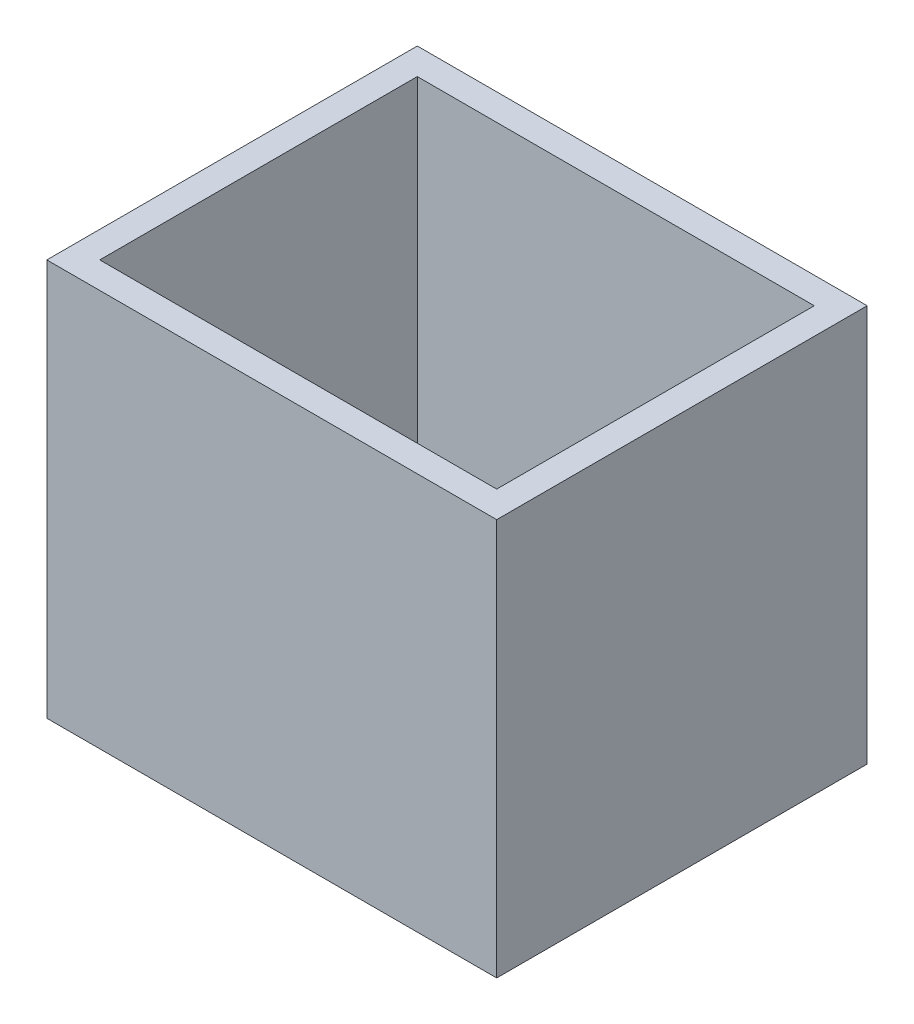
ISO-10303-21;
HEADER;
FILE_DESCRIPTION(('STEP AP214'),'2;1');
FILE_NAME('part.step','',(''),(''),'','','');
FILE_SCHEMA(('AUTOMOTIVE_DESIGN { 1 0 10303 214 1 1 1 1 }'));
ENDSEC;
DATA;
#1=APPLICATION_CONTEXT('core data for automotive mechanical design processes');
#2=APPLICATION_PROTOCOL_DEFINITION('international standard','automotive_design',2000,#1);
#3=PRODUCT_CONTEXT('',#1,'mechanical');
#4=PRODUCT('Part','Part','',(#3));
#5=PRODUCT_RELATED_PRODUCT_CATEGORY('part','',(#4));
#6=PRODUCT_DEFINITION_FORMATION('','',#4);
#7=PRODUCT_DEFINITION_CONTEXT('part definition',#1,'design');
#8=PRODUCT_DEFINITION('design','',#6,#7);
#9=PRODUCT_DEFINITION_SHAPE('','',#8);
#10=(LENGTH_UNIT() NAMED_UNIT(*) SI_UNIT(.MILLI.,.METRE.));
#11=(NAMED_UNIT(*) PLANE_ANGLE_UNIT() SI_UNIT($,.RADIAN.));
#12=(NAMED_UNIT(*) SI_UNIT($,.STERADIAN.) SOLID_ANGLE_UNIT());
#13=UNCERTAINTY_MEASURE_WITH_UNIT(LENGTH_MEASURE(1.E-05),#10,'distance_accuracy_value','');
#14=(GEOMETRIC_REPRESENTATION_CONTEXT(3) GLOBAL_UNCERTAINTY_ASSIGNED_CONTEXT((#13)) GLOBAL_UNIT_ASSIGNED_CONTEXT((#10,
#11,#12)) REPRESENTATION_CONTEXT('',''));
#15=CARTESIAN_POINT('',(0.,0.,0.));
#16=DIRECTION('',(0.,0.,1.));
#17=DIRECTION('',(1.,0.,0.));
#18=AXIS2_PLACEMENT_3D('',#15,#16,#17);
#19=CARTESIAN_POINT('',(0.,4.99999999999999,0.));
#20=DIRECTION('',(0.,1.,0.));
#21=DIRECTION('',(0.,0.,1.));
#22=AXIS2_PLACEMENT_3D('',#19,#20,#21);
#23=PLANE('',#22);
#24=DIRECTION('',(0.,0.,1.));
#25=VECTOR('',#24,1.);
#26=CARTESIAN_POINT('',(5.,4.99999999999999,-65.));
#27=LINE('',#26,#25);
#28=CARTESIAN_POINT('',(5.,4.99999999999999,-65.));
#29=VERTEX_POINT('',#28);
#30=CARTESIAN_POINT('',(5.00000000000001,4.99999999999999,-5.));
#31=VERTEX_POINT('',#30);
#32=EDGE_CURVE('E175',#29,#31,#27,.T.);
#33=ORIENTED_EDGE('',*,*,#32,.T.);
#34=DIRECTION('',(1.,0.,0.));
#35=VECTOR('',#34,1.);
#36=CARTESIAN_POINT('',(5.00000000000001,4.99999999999999,-5.));
#37=LINE('',#36,#35);
#38=CARTESIAN_POINT('',(80.,4.99999999999999,-5.));
#39=VERTEX_POINT('',#38);
#40=EDGE_CURVE('E179',#31,#39,#37,.T.);
#41=ORIENTED_EDGE('',*,*,#40,.T.);
#42=DIRECTION('',(0.,0.,-1.));
#43=VECTOR('',#42,1.);
#44=CARTESIAN_POINT('',(80.,4.99999999999999,-65.));
#45=LINE('',#44,#43);
#46=CARTESIAN_POINT('',(80.,4.99999999999999,-65.));
#47=VERTEX_POINT('',#46);
#48=EDGE_CURVE('E184',#39,#47,#45,.T.);
#49=ORIENTED_EDGE('',*,*,#48,.T.);
#50=DIRECTION('',(-1.,0.,0.));
#51=VECTOR('',#50,1.);
#52=CARTESIAN_POINT('',(5.,4.99999999999999,-65.));
#53=LINE('',#52,#51);
#54=EDGE_CURVE('E188',#47,#29,#53,.T.);
#55=ORIENTED_EDGE('',*,*,#54,.T.);
#56=EDGE_LOOP('',(#33,#41,#49,#55));
#57=FACE_BOUND('',#56,.T.);
#58=DIRECTION('',(1.,0.,0.));
#59=VECTOR('',#58,1.);
#60=CARTESIAN_POINT('',(55.,4.99999999999999,-22.4925910316359));
#61=LINE('',#60,#59);
#62=CARTESIAN_POINT('',(55.,4.99999999999999,-22.4925910316359));
#63=VERTEX_POINT('',#62);
#64=CARTESIAN_POINT('',(75.,4.99999999999999,-22.4925910316359));
#65=VERTEX_POINT('',#64);
#66=EDGE_CURVE('E481',#63,#65,#61,.T.);
#67=ORIENTED_EDGE('',*,*,#66,.F.);
#68=DIRECTION('',(0.,0.,1.));
#69=VECTOR('',#68,1.);
#70=CARTESIAN_POINT('',(55.,4.99999999999999,-42.4925910316359));
#71=LINE('',#70,#69);
#72=CARTESIAN_POINT('',(55.,4.99999999999999,-42.4925910316359));
#73=VERTEX_POINT('',#72);
#74=EDGE_CURVE('E164',#73,#63,#71,.T.);
#75=ORIENTED_EDGE('',*,*,#74,.F.);
#76=DIRECTION('',(-1.,0.,0.));
#77=VECTOR('',#76,1.);
#78=CARTESIAN_POINT('',(55.,4.99999999999999,-42.4925910316359));
#79=LINE('',#78,#77);
#80=CARTESIAN_POINT('',(75.,4.99999999999999,-42.4925910316359));
#81=VERTEX_POINT('',#80);
#82=EDGE_CURVE('E160',#81,#73,#79,.T.);
#83=ORIENTED_EDGE('',*,*,#82,.F.);
#84=DIRECTION('',(0.,0.,-1.));
#85=VECTOR('',#84,1.);
#86=CARTESIAN_POINT('',(75.,4.99999999999999,-42.4925910316359));
#87=LINE('',#86,#85);
#88=EDGE_CURVE('E477',#65,#81,#87,.T.);
#89=ORIENTED_EDGE('',*,*,#88,.F.);
#90=EDGE_LOOP('',(#67,#75,#83,#89));
#91=FACE_BOUND('',#90,.T.);
#92=ADVANCED_FACE('F49',(#57,#91),#23,.T.);
#93=CARTESIAN_POINT('',(85.,75.,-70.));
#94=DIRECTION('',(-1.,0.,0.));
#95=DIRECTION('',(0.,0.,1.));
#96=AXIS2_PLACEMENT_3D('',#93,#94,#95);
#97=PLANE('',#96);
#98=DIRECTION('',(0.,0.,-1.));
#99=VECTOR('',#98,1.);
#100=CARTESIAN_POINT('',(85.,0.,-70.));
#101=LINE('',#100,#99);
#102=CARTESIAN_POINT('',(85.,0.,0.));
#103=VERTEX_POINT('',#102);
#104=CARTESIAN_POINT('',(85.,0.,-70.));
#105=VERTEX_POINT('',#104);
#106=EDGE_CURVE('E206',#103,#105,#101,.T.);
#107=ORIENTED_EDGE('',*,*,#106,.T.);
#108=DIRECTION('',(0.,-1.,0.));
#109=VECTOR('',#108,1.);
#110=CARTESIAN_POINT('',(85.,75.,-70.));
#111=LINE('',#110,#109);
#112=CARTESIAN_POINT('',(85.,75.,-70.));
#113=VERTEX_POINT('',#112);
#114=EDGE_CURVE('E11',#113,#105,#111,.T.);
#115=ORIENTED_EDGE('',*,*,#114,.F.);
#116=DIRECTION('',(0.,0.,-1.));
#117=VECTOR('',#116,1.);
#118=CARTESIAN_POINT('',(85.,75.,-70.));
#119=LINE('',#118,#117);
#120=CARTESIAN_POINT('',(85.,75.,0.));
#121=VERTEX_POINT('',#120);
#122=EDGE_CURVE('E215',#121,#113,#119,.T.);
#123=ORIENTED_EDGE('',*,*,#122,.F.);
#124=DIRECTION('',(0.,-1.,0.));
#125=VECTOR('',#124,1.);
#126=CARTESIAN_POINT('',(85.,75.,0.));
#127=LINE('',#126,#125);
#128=EDGE_CURVE('E229',#121,#103,#127,.T.);
#129=ORIENTED_EDGE('',*,*,#128,.T.);
#130=EDGE_LOOP('',(#107,#115,#123,#129));
#131=FACE_BOUND('',#130,.T.);
#132=ADVANCED_FACE('F51',(#131),#97,.F.);
#133=CARTESIAN_POINT('',(85.,75.,-70.));
#134=DIRECTION('',(0.,0.,1.));
#135=DIRECTION('',(1.,0.,0.));
#136=AXIS2_PLACEMENT_3D('',#133,#134,#135);
#137=PLANE('',#136);
#138=DIRECTION('',(-1.,0.,0.));
#139=VECTOR('',#138,1.);
#140=CARTESIAN_POINT('',(85.,0.,-70.));
#141=LINE('',#140,#139);
#142=CARTESIAN_POINT('',(0.,0.,-70.));
#143=VERTEX_POINT('',#142);
#144=EDGE_CURVE('E233',#105,#143,#141,.T.);
#145=ORIENTED_EDGE('',*,*,#144,.T.);
#146=DIRECTION('',(0.,-1.,0.));
#147=VECTOR('',#146,1.);
#148=CARTESIAN_POINT('',(0.,75.,-70.));
#149=LINE('',#148,#147);
#150=CARTESIAN_POINT('',(0.,75.,-70.));
#151=VERTEX_POINT('',#150);
#152=EDGE_CURVE('E58',#151,#143,#149,.T.);
#153=ORIENTED_EDGE('',*,*,#152,.F.);
#154=DIRECTION('',(-1.,0.,0.));
#155=VECTOR('',#154,1.);
#156=CARTESIAN_POINT('',(85.,75.,-70.));
#157=LINE('',#156,#155);
#158=EDGE_CURVE('E219',#113,#151,#157,.T.);
#159=ORIENTED_EDGE('',*,*,#158,.F.);
#160=ORIENTED_EDGE('',*,*,#114,.T.);
#161=EDGE_LOOP('',(#145,#153,#159,#160));
#162=FACE_BOUND('',#161,.T.);
#163=ADVANCED_FACE('F269',(#162),#137,.F.);
#164=CARTESIAN_POINT('',(0.,75.,-70.));
#165=DIRECTION('',(1.,0.,0.));
#166=DIRECTION('',(0.,0.,-1.));
#167=AXIS2_PLACEMENT_3D('',#164,#165,#166);
#168=PLANE('',#167);
#169=DIRECTION('',(0.,0.,1.));
#170=VECTOR('',#169,1.);
#171=CARTESIAN_POINT('',(0.,0.,-70.));
#172=LINE('',#171,#170);
#173=CARTESIAN_POINT('',(0.,0.,0.));
#174=VERTEX_POINT('',#173);
#175=EDGE_CURVE('E236',#143,#174,#172,.T.);
#176=ORIENTED_EDGE('',*,*,#175,.T.);
#177=DIRECTION('',(0.,-1.,0.));
#178=VECTOR('',#177,1.);
#179=CARTESIAN_POINT('',(0.,75.,0.));
#180=LINE('',#179,#178);
#181=CARTESIAN_POINT('',(0.,75.,0.));
#182=VERTEX_POINT('',#181);
#183=EDGE_CURVE('E244',#182,#174,#180,.T.);
#184=ORIENTED_EDGE('',*,*,#183,.F.);
#185=DIRECTION('',(0.,0.,1.));
#186=VECTOR('',#185,1.);
#187=CARTESIAN_POINT('',(0.,75.,-70.));
#188=LINE('',#187,#186);
#189=EDGE_CURVE('E223',#151,#182,#188,.T.);
#190=ORIENTED_EDGE('',*,*,#189,.F.);
#191=ORIENTED_EDGE('',*,*,#152,.T.);
#192=EDGE_LOOP('',(#176,#184,#190,#191));
#193=FACE_BOUND('',#192,.T.);
#194=ADVANCED_FACE('F253',(#193),#168,.F.);
#195=CARTESIAN_POINT('',(85.,75.,0.));
#196=DIRECTION('',(0.,0.,-1.));
#197=DIRECTION('',(-1.,0.,0.));
#198=AXIS2_PLACEMENT_3D('',#195,#196,#197);
#199=PLANE('',#198);
#200=DIRECTION('',(1.,0.,0.));
#201=VECTOR('',#200,1.);
#202=CARTESIAN_POINT('',(85.,0.,0.));
#203=LINE('',#202,#201);
#204=EDGE_CURVE('E220',#174,#103,#203,.T.);
#205=ORIENTED_EDGE('',*,*,#204,.T.);
#206=ORIENTED_EDGE('',*,*,#128,.F.);
#207=DIRECTION('',(1.,0.,0.));
#208=VECTOR('',#207,1.);
#209=CARTESIAN_POINT('',(85.,75.,0.));
#210=LINE('',#209,#208);
#211=EDGE_CURVE('E226',#182,#121,#210,.T.);
#212=ORIENTED_EDGE('',*,*,#211,.F.);
#213=ORIENTED_EDGE('',*,*,#183,.T.);
#214=EDGE_LOOP('',(#205,#206,#212,#213));
#215=FACE_BOUND('',#214,.T.);
#216=ADVANCED_FACE('F262',(#215),#199,.F.);
#217=CARTESIAN_POINT('',(0.,75.,0.));
#218=DIRECTION('',(0.,-1.,0.));
#219=DIRECTION('',(0.,0.,-1.));
#220=AXIS2_PLACEMENT_3D('',#217,#218,#219);
#221=PLANE('',#220);
#222=DIRECTION('',(1.,0.,0.));
#223=VECTOR('',#222,1.);
#224=CARTESIAN_POINT('',(5.00000000000001,75.,-5.));
#225=LINE('',#224,#223);
#226=CARTESIAN_POINT('',(5.00000000000001,75.,-5.));
#227=VERTEX_POINT('',#226);
#228=CARTESIAN_POINT('',(80.,75.,-5.));
#229=VERTEX_POINT('',#228);
#230=EDGE_CURVE('E170',#227,#229,#225,.T.);
#231=ORIENTED_EDGE('',*,*,#230,.F.);
#232=DIRECTION('',(0.,0.,1.));
#233=VECTOR('',#232,1.);
#234=CARTESIAN_POINT('',(5.,75.,-65.));
#235=LINE('',#234,#233);
#236=CARTESIAN_POINT('',(5.,75.,-65.));
#237=VERTEX_POINT('',#236);
#238=EDGE_CURVE('E73',#237,#227,#235,.T.);
#239=ORIENTED_EDGE('',*,*,#238,.F.);
#240=DIRECTION('',(-1.,0.,0.));
#241=VECTOR('',#240,1.);
#242=CARTESIAN_POINT('',(5.,75.,-65.));
#243=LINE('',#242,#241);
#244=CARTESIAN_POINT('',(80.,75.,-65.));
#245=VERTEX_POINT('',#244);
#246=EDGE_CURVE('E180',#245,#237,#243,.T.);
#247=ORIENTED_EDGE('',*,*,#246,.F.);
#248=DIRECTION('',(0.,0.,-1.));
#249=VECTOR('',#248,1.);
#250=CARTESIAN_POINT('',(80.,75.,-65.));
#251=LINE('',#250,#249);
#252=EDGE_CURVE('E196',#229,#245,#251,.T.);
#253=ORIENTED_EDGE('',*,*,#252,.F.);
#254=EDGE_LOOP('',(#231,#239,#247,#253));
#255=FACE_BOUND('',#254,.T.);
#256=ORIENTED_EDGE('',*,*,#122,.T.);
#257=ORIENTED_EDGE('',*,*,#158,.T.);
#258=ORIENTED_EDGE('',*,*,#189,.T.);
#259=ORIENTED_EDGE('',*,*,#211,.T.);
#260=EDGE_LOOP('',(#256,#257,#258,#259));
#261=FACE_BOUND('',#260,.T.);
#262=ADVANCED_FACE('F268',(#255,#261),#221,.F.);
#263=CARTESIAN_POINT('',(0.,0.,0.));
#264=DIRECTION('',(0.,-1.,0.));
#265=DIRECTION('',(0.,0.,-1.));
#266=AXIS2_PLACEMENT_3D('',#263,#264,#265);
#267=PLANE('',#266);
#268=ORIENTED_EDGE('',*,*,#106,.F.);
#269=ORIENTED_EDGE('',*,*,#204,.F.);
#270=ORIENTED_EDGE('',*,*,#175,.F.);
#271=ORIENTED_EDGE('',*,*,#144,.F.);
#272=EDGE_LOOP('',(#268,#269,#270,#271));
#273=FACE_BOUND('',#272,.T.);
#274=ADVANCED_FACE('F259',(#273),#267,.T.);
#275=CARTESIAN_POINT('',(5.,4.99999999999999,-65.));
#276=DIRECTION('',(-1.,0.,0.));
#277=DIRECTION('',(0.,0.,1.));
#278=AXIS2_PLACEMENT_3D('',#275,#276,#277);
#279=PLANE('',#278);
#280=ORIENTED_EDGE('',*,*,#238,.T.);
#281=DIRECTION('',(0.,1.,0.));
#282=VECTOR('',#281,1.);
#283=CARTESIAN_POINT('',(5.00000000000001,4.99999999999999,-5.));
#284=LINE('',#283,#282);
#285=EDGE_CURVE('E191',#31,#227,#284,.T.);
#286=ORIENTED_EDGE('',*,*,#285,.F.);
#287=ORIENTED_EDGE('',*,*,#32,.F.);
#288=DIRECTION('',(0.,1.,0.));
#289=VECTOR('',#288,1.);
#290=CARTESIAN_POINT('',(5.,4.99999999999999,-65.));
#291=LINE('',#290,#289);
#292=EDGE_CURVE('E203',#29,#237,#291,.T.);
#293=ORIENTED_EDGE('',*,*,#292,.T.);
#294=EDGE_LOOP('',(#280,#286,#287,#293));
#295=FACE_BOUND('',#294,.T.);
#296=ADVANCED_FACE('F289',(#295),#279,.F.);
#297=CARTESIAN_POINT('',(5.,4.99999999999999,-65.));
#298=DIRECTION('',(0.,0.,-1.));
#299=DIRECTION('',(-1.,0.,0.));
#300=AXIS2_PLACEMENT_3D('',#297,#298,#299);
#301=PLANE('',#300);
#302=ORIENTED_EDGE('',*,*,#246,.T.);
#303=ORIENTED_EDGE('',*,*,#292,.F.);
#304=ORIENTED_EDGE('',*,*,#54,.F.);
#305=DIRECTION('',(0.,1.,0.));
#306=VECTOR('',#305,1.);
#307=CARTESIAN_POINT('',(80.,4.99999999999999,-65.));
#308=LINE('',#307,#306);
#309=EDGE_CURVE('E207',#47,#245,#308,.T.);
#310=ORIENTED_EDGE('',*,*,#309,.T.);
#311=EDGE_LOOP('',(#302,#303,#304,#310));
#312=FACE_BOUND('',#311,.T.);
#313=ADVANCED_FACE('F285',(#312),#301,.F.);
#314=CARTESIAN_POINT('',(80.,4.99999999999999,-65.));
#315=DIRECTION('',(1.,0.,0.));
#316=DIRECTION('',(0.,0.,-1.));
#317=AXIS2_PLACEMENT_3D('',#314,#315,#316);
#318=PLANE('',#317);
#319=ORIENTED_EDGE('',*,*,#252,.T.);
#320=ORIENTED_EDGE('',*,*,#309,.F.);
#321=ORIENTED_EDGE('',*,*,#48,.F.);
#322=DIRECTION('',(0.,1.,0.));
#323=VECTOR('',#322,1.);
#324=CARTESIAN_POINT('',(80.,4.99999999999999,-5.));
#325=LINE('',#324,#323);
#326=EDGE_CURVE('E210',#39,#229,#325,.T.);
#327=ORIENTED_EDGE('',*,*,#326,.T.);
#328=EDGE_LOOP('',(#319,#320,#321,#327));
#329=FACE_BOUND('',#328,.T.);
#330=ADVANCED_FACE('F288',(#329),#318,.F.);
#331=CARTESIAN_POINT('',(5.00000000000001,4.99999999999999,-5.));
#332=DIRECTION('',(0.,0.,1.));
#333=DIRECTION('',(1.,0.,0.));
#334=AXIS2_PLACEMENT_3D('',#331,#332,#333);
#335=PLANE('',#334);
#336=ORIENTED_EDGE('',*,*,#230,.T.);
#337=ORIENTED_EDGE('',*,*,#326,.F.);
#338=ORIENTED_EDGE('',*,*,#40,.F.);
#339=ORIENTED_EDGE('',*,*,#285,.T.);
#340=EDGE_LOOP('',(#336,#337,#338,#339));
#341=FACE_BOUND('',#340,.T.);
#342=ADVANCED_FACE('F293',(#341),#335,.F.);
#343=CARTESIAN_POINT('',(55.,30.,-42.4925910316359));
#344=DIRECTION('',(1.,0.,0.));
#345=DIRECTION('',(0.,0.,-1.));
#346=AXIS2_PLACEMENT_3D('',#343,#344,#345);
#347=PLANE('',#346);
#348=ORIENTED_EDGE('',*,*,#74,.T.);
#349=DIRECTION('',(0.,-1.,0.));
#350=VECTOR('',#349,1.);
#351=CARTESIAN_POINT('',(55.,30.,-22.4925910316359));
#352=LINE('',#351,#350);
#353=CARTESIAN_POINT('',(55.,30.,-22.4925910316359));
#354=VERTEX_POINT('',#353);
#355=EDGE_CURVE('E143',#354,#63,#352,.T.);
#356=ORIENTED_EDGE('',*,*,#355,.F.);
#357=DIRECTION('',(0.,0.,1.));
#358=VECTOR('',#357,1.);
#359=CARTESIAN_POINT('',(55.,30.,-42.4925910316359));
#360=LINE('',#359,#358);
#361=CARTESIAN_POINT('',(55.,30.,-42.4925910316359));
#362=VERTEX_POINT('',#361);
#363=EDGE_CURVE('E151',#362,#354,#360,.T.);
#364=ORIENTED_EDGE('',*,*,#363,.F.);
#365=DIRECTION('',(0.,-1.,0.));
#366=VECTOR('',#365,1.);
#367=CARTESIAN_POINT('',(55.,30.,-42.4925910316359));
#368=LINE('',#367,#366);
#369=EDGE_CURVE('E474',#362,#73,#368,.T.);
#370=ORIENTED_EDGE('',*,*,#369,.T.);
#371=EDGE_LOOP('',(#348,#356,#364,#370));
#372=FACE_BOUND('',#371,.T.);
#373=ADVANCED_FACE('F162',(#372),#347,.F.);
#374=CARTESIAN_POINT('',(55.,30.,-22.4925910316359));
#375=DIRECTION('',(0.,0.,-1.));
#376=DIRECTION('',(-1.,0.,0.));
#377=AXIS2_PLACEMENT_3D('',#374,#375,#376);
#378=PLANE('',#377);
#379=ORIENTED_EDGE('',*,*,#66,.T.);
#380=DIRECTION('',(0.,-1.,0.));
#381=VECTOR('',#380,1.);
#382=CARTESIAN_POINT('',(75.,30.,-22.4925910316359));
#383=LINE('',#382,#381);
#384=CARTESIAN_POINT('',(75.,30.,-22.4925910316359));
#385=VERTEX_POINT('',#384);
#386=EDGE_CURVE('E146',#385,#65,#383,.T.);
#387=ORIENTED_EDGE('',*,*,#386,.F.);
#388=DIRECTION('',(1.,0.,0.));
#389=VECTOR('',#388,1.);
#390=CARTESIAN_POINT('',(55.,30.,-22.4925910316359));
#391=LINE('',#390,#389);
#392=EDGE_CURVE('E139',#354,#385,#391,.T.);
#393=ORIENTED_EDGE('',*,*,#392,.F.);
#394=ORIENTED_EDGE('',*,*,#355,.T.);
#395=EDGE_LOOP('',(#379,#387,#393,#394));
#396=FACE_BOUND('',#395,.T.);
#397=ADVANCED_FACE('F141',(#396),#378,.F.);
#398=CARTESIAN_POINT('',(75.,30.,-42.4925910316359));
#399=DIRECTION('',(-1.,0.,0.));
#400=DIRECTION('',(0.,0.,1.));
#401=AXIS2_PLACEMENT_3D('',#398,#399,#400);
#402=PLANE('',#401);
#403=ORIENTED_EDGE('',*,*,#88,.T.);
#404=DIRECTION('',(0.,-1.,0.));
#405=VECTOR('',#404,1.);
#406=CARTESIAN_POINT('',(75.,30.,-42.4925910316359));
#407=LINE('',#406,#405);
#408=CARTESIAN_POINT('',(75.,30.,-42.4925910316359));
#409=VERTEX_POINT('',#408);
#410=EDGE_CURVE('E65',#409,#81,#407,.T.);
#411=ORIENTED_EDGE('',*,*,#410,.F.);
#412=DIRECTION('',(0.,0.,-1.));
#413=VECTOR('',#412,1.);
#414=CARTESIAN_POINT('',(75.,30.,-42.4925910316359));
#415=LINE('',#414,#413);
#416=EDGE_CURVE('E150',#385,#409,#415,.T.);
#417=ORIENTED_EDGE('',*,*,#416,.F.);
#418=ORIENTED_EDGE('',*,*,#386,.T.);
#419=EDGE_LOOP('',(#403,#411,#417,#418));
#420=FACE_BOUND('',#419,.T.);
#421=ADVANCED_FACE('F345',(#420),#402,.F.);
#422=CARTESIAN_POINT('',(55.,30.,-42.4925910316359));
#423=DIRECTION('',(0.,0.,1.));
#424=DIRECTION('',(1.,0.,0.));
#425=AXIS2_PLACEMENT_3D('',#422,#423,#424);
#426=PLANE('',#425);
#427=ORIENTED_EDGE('',*,*,#82,.T.);
#428=ORIENTED_EDGE('',*,*,#369,.F.);
#429=DIRECTION('',(-1.,0.,0.));
#430=VECTOR('',#429,1.);
#431=CARTESIAN_POINT('',(55.,30.,-42.4925910316359));
#432=LINE('',#431,#430);
#433=EDGE_CURVE('E155',#409,#362,#432,.T.);
#434=ORIENTED_EDGE('',*,*,#433,.F.);
#435=ORIENTED_EDGE('',*,*,#410,.T.);
#436=EDGE_LOOP('',(#427,#428,#434,#435));
#437=FACE_BOUND('',#436,.T.);
#438=ADVANCED_FACE('F351',(#437),#426,.F.);
#439=CARTESIAN_POINT('',(0.,30.,0.));
#440=DIRECTION('',(0.,1.,0.));
#441=DIRECTION('',(0.,0.,1.));
#442=AXIS2_PLACEMENT_3D('',#439,#440,#441);
#443=PLANE('',#442);
#444=ORIENTED_EDGE('',*,*,#363,.T.);
#445=ORIENTED_EDGE('',*,*,#392,.T.);
#446=ORIENTED_EDGE('',*,*,#416,.T.);
#447=ORIENTED_EDGE('',*,*,#433,.T.);
#448=EDGE_LOOP('',(#444,#445,#446,#447));
#449=FACE_BOUND('',#448,.T.);
#450=ADVANCED_FACE('F154',(#449),#443,.T.);
#451=CLOSED_SHELL('',(#92,#132,#163,#194,#216,#262,#274,#296,#313,#330,#342,#373,#397,#421,#438,#450));
#452=MANIFOLD_SOLID_BREP('B2',#451);
#453=ADVANCED_BREP_SHAPE_REPRESENTATION('',(#18,#452),#14);
#454=SHAPE_DEFINITION_REPRESENTATION(#9,#453);
ENDSEC;
END-ISO-10303-21;
